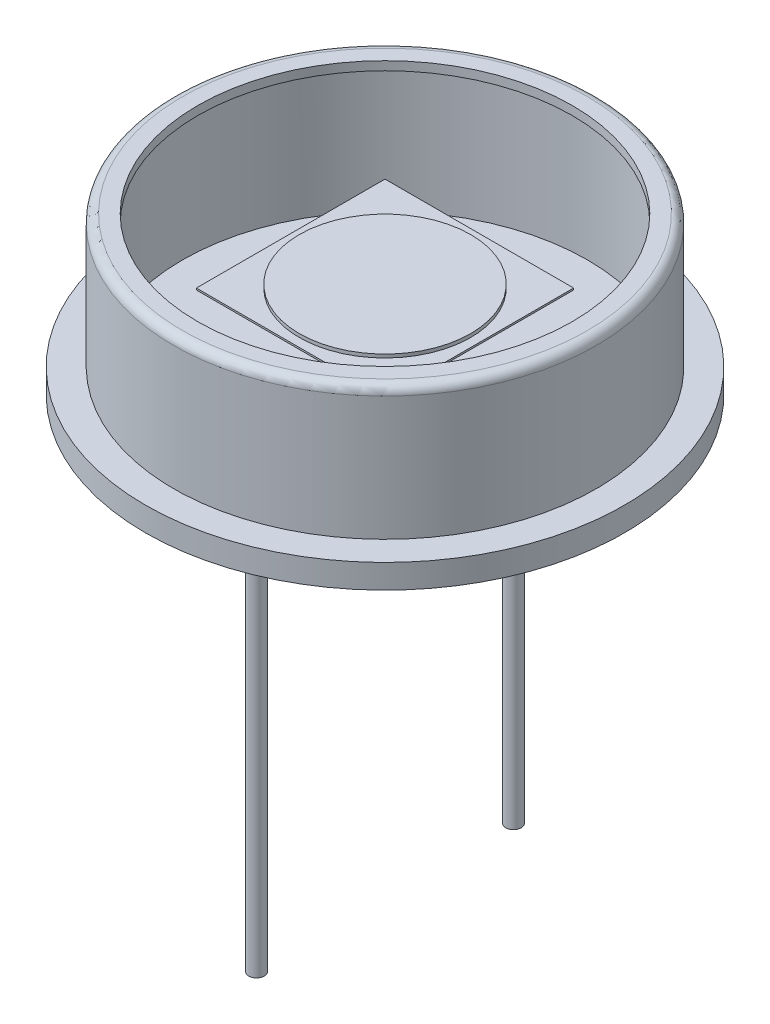
ISO-10303-21;
HEADER;
FILE_DESCRIPTION(('STEP AP214'),'2;1');
FILE_NAME('part.step','',(''),(''),'','','');
FILE_SCHEMA(('AUTOMOTIVE_DESIGN { 1 0 10303 214 1 1 1 1 }'));
ENDSEC;
DATA;
#1=APPLICATION_CONTEXT('core data for automotive mechanical design processes');
#2=APPLICATION_PROTOCOL_DEFINITION('international standard','automotive_design',2000,#1);
#3=PRODUCT_CONTEXT('',#1,'mechanical');
#4=PRODUCT('Part','Part','',(#3));
#5=PRODUCT_RELATED_PRODUCT_CATEGORY('part','',(#4));
#6=PRODUCT_DEFINITION_FORMATION('','',#4);
#7=PRODUCT_DEFINITION_CONTEXT('part definition',#1,'design');
#8=PRODUCT_DEFINITION('design','',#6,#7);
#9=PRODUCT_DEFINITION_SHAPE('','',#8);
#10=(LENGTH_UNIT() NAMED_UNIT(*) SI_UNIT(.MILLI.,.METRE.));
#11=(NAMED_UNIT(*) PLANE_ANGLE_UNIT() SI_UNIT($,.RADIAN.));
#12=(NAMED_UNIT(*) SI_UNIT($,.STERADIAN.) SOLID_ANGLE_UNIT());
#13=UNCERTAINTY_MEASURE_WITH_UNIT(LENGTH_MEASURE(1.E-05),#10,'distance_accuracy_value','');
#14=(GEOMETRIC_REPRESENTATION_CONTEXT(3) GLOBAL_UNCERTAINTY_ASSIGNED_CONTEXT((#13)) GLOBAL_UNIT_ASSIGNED_CONTEXT((#10,
#11,#12)) REPRESENTATION_CONTEXT('',''));
#15=CARTESIAN_POINT('',(0.,0.,0.));
#16=DIRECTION('',(0.,0.,1.));
#17=DIRECTION('',(1.,0.,0.));
#18=AXIS2_PLACEMENT_3D('',#15,#16,#17);
#19=CARTESIAN_POINT('',(-2.75,2.69,-2.75));
#20=DIRECTION('',(0.,-1.,0.));
#21=DIRECTION('',(0.,0.,-1.));
#22=AXIS2_PLACEMENT_3D('',#19,#20,#21);
#23=PLANE('',#22);
#24=DIRECTION('',(0.,0.,-1.));
#25=VECTOR('',#24,1.);
#26=CARTESIAN_POINT('',(-2.75,2.69,2.75));
#27=LINE('',#26,#25);
#28=CARTESIAN_POINT('',(-2.75,2.69,2.75));
#29=VERTEX_POINT('',#28);
#30=CARTESIAN_POINT('',(-2.75,2.69,-2.75));
#31=VERTEX_POINT('',#30);
#32=EDGE_CURVE('E109',#29,#31,#27,.T.);
#33=ORIENTED_EDGE('',*,*,#32,.F.);
#34=DIRECTION('',(-1.,0.,0.));
#35=VECTOR('',#34,1.);
#36=CARTESIAN_POINT('',(-2.75,2.69,2.75));
#37=LINE('',#36,#35);
#38=CARTESIAN_POINT('',(2.75,2.69,2.75));
#39=VERTEX_POINT('',#38);
#40=EDGE_CURVE('E82',#39,#29,#37,.T.);
#41=ORIENTED_EDGE('',*,*,#40,.F.);
#42=DIRECTION('',(0.,0.,1.));
#43=VECTOR('',#42,1.);
#44=CARTESIAN_POINT('',(2.75,2.69,2.75));
#45=LINE('',#44,#43);
#46=CARTESIAN_POINT('',(2.75,2.69,-2.75));
#47=VERTEX_POINT('',#46);
#48=EDGE_CURVE('E76',#47,#39,#45,.T.);
#49=ORIENTED_EDGE('',*,*,#48,.F.);
#50=DIRECTION('',(1.,0.,0.));
#51=VECTOR('',#50,1.);
#52=CARTESIAN_POINT('',(-2.75,2.69,-2.75));
#53=LINE('',#52,#51);
#54=EDGE_CURVE('E100',#31,#47,#53,.T.);
#55=ORIENTED_EDGE('',*,*,#54,.F.);
#56=EDGE_LOOP('',(#33,#41,#49,#55));
#57=FACE_BOUND('',#56,.T.);
#58=CARTESIAN_POINT('',(0.,2.69,0.));
#59=DIRECTION('',(0.,-1.,0.));
#60=DIRECTION('',(0.,0.,-1.));
#61=AXIS2_PLACEMENT_3D('',#58,#59,#60);
#62=CIRCLE('',#61,2.5);
#63=CARTESIAN_POINT('',(0.,2.69,-2.5));
#64=VERTEX_POINT('',#63);
#65=EDGE_CURVE('E12',#64,#64,#62,.F.);
#66=ORIENTED_EDGE('',*,*,#65,.F.);
#67=EDGE_LOOP('',(#66));
#68=FACE_BOUND('',#67,.T.);
#69=ADVANCED_FACE('F42',(#57,#68),#23,.F.);
#70=CARTESIAN_POINT('',(-2.75,2.64,2.75));
#71=DIRECTION('',(1.,0.,0.));
#72=DIRECTION('',(0.,0.,-1.));
#73=AXIS2_PLACEMENT_3D('',#70,#71,#72);
#74=PLANE('',#73);
#75=ORIENTED_EDGE('',*,*,#32,.T.);
#76=DIRECTION('',(0.,1.,0.));
#77=VECTOR('',#76,1.);
#78=CARTESIAN_POINT('',(-2.75,2.64,-2.75));
#79=LINE('',#78,#77);
#80=CARTESIAN_POINT('',(-2.75,2.64,-2.75));
#81=VERTEX_POINT('',#80);
#82=EDGE_CURVE('E51',#81,#31,#79,.T.);
#83=ORIENTED_EDGE('',*,*,#82,.F.);
#84=DIRECTION('',(0.,0.,-1.));
#85=VECTOR('',#84,1.);
#86=CARTESIAN_POINT('',(-2.75,2.64,2.75));
#87=LINE('',#86,#85);
#88=CARTESIAN_POINT('',(-2.75,2.64,2.75));
#89=VERTEX_POINT('',#88);
#90=EDGE_CURVE('E95',#89,#81,#87,.T.);
#91=ORIENTED_EDGE('',*,*,#90,.F.);
#92=DIRECTION('',(0.,1.,0.));
#93=VECTOR('',#92,1.);
#94=CARTESIAN_POINT('',(-2.75,2.64,2.75));
#95=LINE('',#94,#93);
#96=EDGE_CURVE('E105',#89,#29,#95,.T.);
#97=ORIENTED_EDGE('',*,*,#96,.T.);
#98=EDGE_LOOP('',(#75,#83,#91,#97));
#99=FACE_BOUND('',#98,.T.);
#100=ADVANCED_FACE('F44',(#99),#74,.F.);
#101=CARTESIAN_POINT('',(-2.75,2.64,-2.75));
#102=DIRECTION('',(0.,0.,1.));
#103=DIRECTION('',(1.,0.,0.));
#104=AXIS2_PLACEMENT_3D('',#101,#102,#103);
#105=PLANE('',#104);
#106=ORIENTED_EDGE('',*,*,#54,.T.);
#107=DIRECTION('',(0.,1.,0.));
#108=VECTOR('',#107,1.);
#109=CARTESIAN_POINT('',(2.75,2.64,-2.75));
#110=LINE('',#109,#108);
#111=CARTESIAN_POINT('',(2.75,2.64,-2.75));
#112=VERTEX_POINT('',#111);
#113=EDGE_CURVE('E98',#112,#47,#110,.T.);
#114=ORIENTED_EDGE('',*,*,#113,.F.);
#115=DIRECTION('',(1.,0.,0.));
#116=VECTOR('',#115,1.);
#117=CARTESIAN_POINT('',(-2.75,2.64,-2.75));
#118=LINE('',#117,#116);
#119=EDGE_CURVE('E90',#81,#112,#118,.T.);
#120=ORIENTED_EDGE('',*,*,#119,.F.);
#121=ORIENTED_EDGE('',*,*,#82,.T.);
#122=EDGE_LOOP('',(#106,#114,#120,#121));
#123=FACE_BOUND('',#122,.T.);
#124=ADVANCED_FACE('F99',(#123),#105,.F.);
#125=CARTESIAN_POINT('',(2.75,2.64,2.75));
#126=DIRECTION('',(-1.,0.,0.));
#127=DIRECTION('',(0.,0.,1.));
#128=AXIS2_PLACEMENT_3D('',#125,#126,#127);
#129=PLANE('',#128);
#130=ORIENTED_EDGE('',*,*,#48,.T.);
#131=DIRECTION('',(0.,1.,0.));
#132=VECTOR('',#131,1.);
#133=CARTESIAN_POINT('',(2.75,2.64,2.75));
#134=LINE('',#133,#132);
#135=CARTESIAN_POINT('',(2.75,2.64,2.75));
#136=VERTEX_POINT('',#135);
#137=EDGE_CURVE('E101',#136,#39,#134,.T.);
#138=ORIENTED_EDGE('',*,*,#137,.F.);
#139=DIRECTION('',(0.,0.,1.));
#140=VECTOR('',#139,1.);
#141=CARTESIAN_POINT('',(2.75,2.64,2.75));
#142=LINE('',#141,#140);
#143=EDGE_CURVE('E93',#112,#136,#142,.T.);
#144=ORIENTED_EDGE('',*,*,#143,.F.);
#145=ORIENTED_EDGE('',*,*,#113,.T.);
#146=EDGE_LOOP('',(#130,#138,#144,#145));
#147=FACE_BOUND('',#146,.T.);
#148=ADVANCED_FACE('F103',(#147),#129,.F.);
#149=CARTESIAN_POINT('',(-2.75,2.64,2.75));
#150=DIRECTION('',(0.,0.,-1.));
#151=DIRECTION('',(-1.,0.,0.));
#152=AXIS2_PLACEMENT_3D('',#149,#150,#151);
#153=PLANE('',#152);
#154=ORIENTED_EDGE('',*,*,#40,.T.);
#155=ORIENTED_EDGE('',*,*,#96,.F.);
#156=DIRECTION('',(-1.,0.,0.));
#157=VECTOR('',#156,1.);
#158=CARTESIAN_POINT('',(-2.75,2.64,2.75));
#159=LINE('',#158,#157);
#160=EDGE_CURVE('E59',#136,#89,#159,.T.);
#161=ORIENTED_EDGE('',*,*,#160,.F.);
#162=ORIENTED_EDGE('',*,*,#137,.T.);
#163=EDGE_LOOP('',(#154,#155,#161,#162));
#164=FACE_BOUND('',#163,.T.);
#165=ADVANCED_FACE('F136',(#164),#153,.F.);
#166=CARTESIAN_POINT('',(-2.75,2.64,-2.75));
#167=DIRECTION('',(0.,-1.,0.));
#168=DIRECTION('',(0.,0.,-1.));
#169=AXIS2_PLACEMENT_3D('',#166,#167,#168);
#170=PLANE('',#169);
#171=ORIENTED_EDGE('',*,*,#90,.T.);
#172=ORIENTED_EDGE('',*,*,#119,.T.);
#173=ORIENTED_EDGE('',*,*,#143,.T.);
#174=ORIENTED_EDGE('',*,*,#160,.T.);
#175=EDGE_LOOP('',(#171,#172,#173,#174));
#176=FACE_BOUND('',#175,.T.);
#177=ADVANCED_FACE('F91',(#176),#170,.T.);
#178=CARTESIAN_POINT('',(0.,2.79,0.));
#179=DIRECTION('',(0.,-1.,0.));
#180=DIRECTION('',(0.,0.,-1.));
#181=AXIS2_PLACEMENT_3D('',#178,#179,#180);
#182=CYLINDRICAL_SURFACE('',#181,2.5);
#183=CARTESIAN_POINT('',(0.,2.79,0.));
#184=DIRECTION('',(0.,1.,0.));
#185=DIRECTION('',(0.,0.,1.));
#186=AXIS2_PLACEMENT_3D('',#183,#184,#185);
#187=CIRCLE('',#186,2.5);
#188=CARTESIAN_POINT('',(0.,2.79,2.5));
#189=VERTEX_POINT('',#188);
#190=EDGE_CURVE('E112',#189,#189,#187,.T.);
#191=ORIENTED_EDGE('',*,*,#190,.F.);
#192=EDGE_LOOP('',(#191));
#193=FACE_BOUND('',#192,.T.);
#194=ORIENTED_EDGE('',*,*,#65,.T.);
#195=EDGE_LOOP('',(#194));
#196=FACE_BOUND('',#195,.T.);
#197=ADVANCED_FACE('F125',(#193,#196),#182,.T.);
#198=CARTESIAN_POINT('',(0.,2.79,0.));
#199=DIRECTION('',(0.,1.,0.));
#200=DIRECTION('',(0.,0.,1.));
#201=AXIS2_PLACEMENT_3D('',#198,#199,#200);
#202=PLANE('',#201);
#203=ORIENTED_EDGE('',*,*,#190,.T.);
#204=EDGE_LOOP('',(#203));
#205=FACE_BOUND('',#204,.T.);
#206=ADVANCED_FACE('F127',(#205),#202,.T.);
#207=CLOSED_SHELL('',(#69,#100,#124,#148,#165,#177,#197,#206));
#208=MANIFOLD_SOLID_BREP('B2',#207);
#209=CARTESIAN_POINT('',(6.985,0.,0.));
#210=DIRECTION('',(0.,1.,0.));
#211=DIRECTION('',(0.,0.,1.));
#212=AXIS2_PLACEMENT_3D('',#209,#210,#211);
#213=PLANE('',#212);
#214=CARTESIAN_POINT('',(0.,0.,3.745));
#215=DIRECTION('',(0.,1.,0.));
#216=DIRECTION('',(0.,0.,1.));
#217=AXIS2_PLACEMENT_3D('',#214,#215,#216);
#218=CIRCLE('',#217,0.75);
#219=CARTESIAN_POINT('',(0.,0.,4.495));
#220=VERTEX_POINT('',#219);
#221=EDGE_CURVE('E204',#220,#220,#218,.F.);
#222=ORIENTED_EDGE('',*,*,#221,.F.);
#223=EDGE_LOOP('',(#222));
#224=FACE_BOUND('',#223,.T.);
#225=CARTESIAN_POINT('',(0.,0.,-3.745));
#226=DIRECTION('',(0.,1.,0.));
#227=DIRECTION('',(0.,0.,1.));
#228=AXIS2_PLACEMENT_3D('',#225,#226,#227);
#229=CIRCLE('',#228,0.225000000000001);
#230=CARTESIAN_POINT('',(0.,0.,-3.52));
#231=VERTEX_POINT('',#230);
#232=EDGE_CURVE('E208',#231,#231,#229,.F.);
#233=ORIENTED_EDGE('',*,*,#232,.F.);
#234=EDGE_LOOP('',(#233));
#235=FACE_BOUND('',#234,.T.);
#236=CARTESIAN_POINT('',(0.,0.,0.));
#237=DIRECTION('',(0.,-1.,0.));
#238=DIRECTION('',(0.,0.,-1.));
#239=AXIS2_PLACEMENT_3D('',#236,#237,#238);
#240=CIRCLE('',#239,6.985);
#241=CARTESIAN_POINT('',(0.,0.,-6.985));
#242=VERTEX_POINT('',#241);
#243=EDGE_CURVE('E228',#242,#242,#240,.T.);
#244=ORIENTED_EDGE('',*,*,#243,.T.);
#245=EDGE_LOOP('',(#244));
#246=FACE_BOUND('',#245,.T.);
#247=CARTESIAN_POINT('',(-1.97931774602012,0.,-4.71761741307297));
#248=DIRECTION('',(0.,1.,0.));
#249=DIRECTION('',(0.,0.,1.));
#250=AXIS2_PLACEMENT_3D('',#247,#248,#249);
#251=CIRCLE('',#250,0.945778117285004);
#252=CARTESIAN_POINT('',(-1.97931774602012,0.,-3.77183929578797));
#253=VERTEX_POINT('',#252);
#254=EDGE_CURVE('E41',#253,#253,#251,.F.);
#255=ORIENTED_EDGE('',*,*,#254,.F.);
#256=EDGE_LOOP('',(#255));
#257=FACE_BOUND('',#256,.T.);
#258=ADVANCED_FACE('F197',(#224,#235,#246,#257),#213,.F.);
#259=CARTESIAN_POINT('',(5.906,4.57,0.));
#260=DIRECTION('',(0.,1.,0.));
#261=DIRECTION('',(0.,0.,1.));
#262=AXIS2_PLACEMENT_3D('',#259,#260,#261);
#263=PLANE('',#262);
#264=CARTESIAN_POINT('',(0.,4.57,0.));
#265=DIRECTION('',(0.,-1.,0.));
#266=DIRECTION('',(0.,0.,-1.));
#267=AXIS2_PLACEMENT_3D('',#264,#265,#266);
#268=CIRCLE('',#267,5.46);
#269=CARTESIAN_POINT('',(0.,4.57,-5.46));
#270=VERTEX_POINT('',#269);
#271=EDGE_CURVE('E212',#270,#270,#268,.T.);
#272=ORIENTED_EDGE('',*,*,#271,.T.);
#273=EDGE_LOOP('',(#272));
#274=FACE_BOUND('',#273,.T.);
#275=CARTESIAN_POINT('',(0.,4.57,0.));
#276=DIRECTION('',(0.,-1.,0.));
#277=DIRECTION('',(0.,0.,-1.));
#278=AXIS2_PLACEMENT_3D('',#275,#276,#277);
#279=CIRCLE('',#278,5.906);
#280=CARTESIAN_POINT('',(0.,4.57,-5.906));
#281=VERTEX_POINT('',#280);
#282=EDGE_CURVE('E240',#281,#281,#279,.T.);
#283=ORIENTED_EDGE('',*,*,#282,.F.);
#284=EDGE_LOOP('',(#283));
#285=FACE_BOUND('',#284,.T.);
#286=ADVANCED_FACE('F199',(#274,#285),#263,.T.);
#287=CARTESIAN_POINT('',(0.,0.,0.));
#288=DIRECTION('',(0.,-1.,0.));
#289=DIRECTION('',(0.,0.,-1.));
#290=AXIS2_PLACEMENT_3D('',#287,#288,#289);
#291=CYLINDRICAL_SURFACE('',#290,5.46);
#292=ORIENTED_EDGE('',*,*,#271,.F.);
#293=EDGE_LOOP('',(#292));
#294=FACE_BOUND('',#293,.T.);
#295=CARTESIAN_POINT('',(0.,4.316,0.));
#296=DIRECTION('',(0.,-1.,0.));
#297=DIRECTION('',(0.,0.,-1.));
#298=AXIS2_PLACEMENT_3D('',#295,#296,#297);
#299=CIRCLE('',#298,5.46);
#300=CARTESIAN_POINT('',(0.,4.316,-5.46));
#301=VERTEX_POINT('',#300);
#302=EDGE_CURVE('E222',#301,#301,#299,.T.);
#303=ORIENTED_EDGE('',*,*,#302,.T.);
#304=EDGE_LOOP('',(#303));
#305=FACE_BOUND('',#304,.T.);
#306=ADVANCED_FACE('F278',(#294,#305),#291,.F.);
#307=CARTESIAN_POINT('',(5.906,4.316,0.));
#308=DIRECTION('',(0.,1.,0.));
#309=DIRECTION('',(0.,0.,1.));
#310=AXIS2_PLACEMENT_3D('',#307,#308,#309);
#311=PLANE('',#310);
#312=ORIENTED_EDGE('',*,*,#302,.F.);
#313=EDGE_LOOP('',(#312));
#314=FACE_BOUND('',#313,.T.);
#315=CARTESIAN_POINT('',(0.,4.316,0.));
#316=DIRECTION('',(0.,-1.,0.));
#317=DIRECTION('',(0.,0.,-1.));
#318=AXIS2_PLACEMENT_3D('',#315,#316,#317);
#319=CIRCLE('',#318,5.906);
#320=CARTESIAN_POINT('',(0.,4.316,-5.906));
#321=VERTEX_POINT('',#320);
#322=EDGE_CURVE('E225',#321,#321,#319,.T.);
#323=ORIENTED_EDGE('',*,*,#322,.T.);
#324=EDGE_LOOP('',(#323));
#325=FACE_BOUND('',#324,.T.);
#326=ADVANCED_FACE('F288',(#314,#325),#311,.F.);
#327=CARTESIAN_POINT('',(0.,0.,0.));
#328=DIRECTION('',(0.,-1.,0.));
#329=DIRECTION('',(0.,0.,-1.));
#330=AXIS2_PLACEMENT_3D('',#327,#328,#329);
#331=CYLINDRICAL_SURFACE('',#330,5.906);
#332=ORIENTED_EDGE('',*,*,#322,.F.);
#333=EDGE_LOOP('',(#332));
#334=FACE_BOUND('',#333,.T.);
#335=CARTESIAN_POINT('',(0.,0.446,0.));
#336=DIRECTION('',(0.,1.,0.));
#337=DIRECTION('',(0.,0.,1.));
#338=AXIS2_PLACEMENT_3D('',#335,#336,#337);
#339=CIRCLE('',#338,5.906);
#340=CARTESIAN_POINT('',(0.,0.446,5.906));
#341=VERTEX_POINT('',#340);
#342=EDGE_CURVE('E243',#341,#341,#339,.F.);
#343=ORIENTED_EDGE('',*,*,#342,.T.);
#344=EDGE_LOOP('',(#343));
#345=FACE_BOUND('',#344,.T.);
#346=ADVANCED_FACE('F285',(#334,#345),#331,.F.);
#347=CARTESIAN_POINT('',(0.,0.,0.));
#348=DIRECTION('',(0.,-1.,0.));
#349=DIRECTION('',(0.,0.,-1.));
#350=AXIS2_PLACEMENT_3D('',#347,#348,#349);
#351=CYLINDRICAL_SURFACE('',#350,6.985);
#352=CARTESIAN_POINT('',(0.,0.7,0.));
#353=DIRECTION('',(0.,-1.,0.));
#354=DIRECTION('',(0.,0.,-1.));
#355=AXIS2_PLACEMENT_3D('',#352,#353,#354);
#356=CIRCLE('',#355,6.985);
#357=CARTESIAN_POINT('',(0.,0.7,-6.985));
#358=VERTEX_POINT('',#357);
#359=EDGE_CURVE('E231',#358,#358,#356,.T.);
#360=ORIENTED_EDGE('',*,*,#359,.T.);
#361=EDGE_LOOP('',(#360));
#362=FACE_BOUND('',#361,.T.);
#363=ORIENTED_EDGE('',*,*,#243,.F.);
#364=EDGE_LOOP('',(#363));
#365=FACE_BOUND('',#364,.T.);
#366=ADVANCED_FACE('F283',(#362,#365),#351,.T.);
#367=CARTESIAN_POINT('',(6.985,0.7,0.));
#368=DIRECTION('',(0.,1.,0.));
#369=DIRECTION('',(0.,0.,1.));
#370=AXIS2_PLACEMENT_3D('',#367,#368,#369);
#371=PLANE('',#370);
#372=CARTESIAN_POINT('',(0.,0.7,0.));
#373=DIRECTION('',(0.,-1.,0.));
#374=DIRECTION('',(0.,0.,-1.));
#375=AXIS2_PLACEMENT_3D('',#372,#373,#374);
#376=CIRCLE('',#375,6.16);
#377=CARTESIAN_POINT('',(0.,0.7,-6.16));
#378=VERTEX_POINT('',#377);
#379=EDGE_CURVE('E234',#378,#378,#376,.T.);
#380=ORIENTED_EDGE('',*,*,#379,.T.);
#381=EDGE_LOOP('',(#380));
#382=FACE_BOUND('',#381,.T.);
#383=ORIENTED_EDGE('',*,*,#359,.F.);
#384=EDGE_LOOP('',(#383));
#385=FACE_BOUND('',#384,.T.);
#386=ADVANCED_FACE('F322',(#382,#385),#371,.T.);
#387=CARTESIAN_POINT('',(0.,0.,0.));
#388=DIRECTION('',(0.,-1.,0.));
#389=DIRECTION('',(0.,0.,-1.));
#390=AXIS2_PLACEMENT_3D('',#387,#388,#389);
#391=CYLINDRICAL_SURFACE('',#390,6.16);
#392=CARTESIAN_POINT('',(0.,4.316,0.));
#393=DIRECTION('',(0.,-1.,0.));
#394=DIRECTION('',(0.,0.,-1.));
#395=AXIS2_PLACEMENT_3D('',#392,#393,#394);
#396=CIRCLE('',#395,6.16);
#397=CARTESIAN_POINT('',(0.,4.316,-6.16));
#398=VERTEX_POINT('',#397);
#399=EDGE_CURVE('E237',#398,#398,#396,.T.);
#400=ORIENTED_EDGE('',*,*,#399,.T.);
#401=EDGE_LOOP('',(#400));
#402=FACE_BOUND('',#401,.T.);
#403=ORIENTED_EDGE('',*,*,#379,.F.);
#404=EDGE_LOOP('',(#403));
#405=FACE_BOUND('',#404,.T.);
#406=ADVANCED_FACE('F316',(#402,#405),#391,.T.);
#407=CARTESIAN_POINT('',(0.,4.316,0.));
#408=DIRECTION('',(0.,-1.,0.));
#409=DIRECTION('',(0.,0.,-1.));
#410=AXIS2_PLACEMENT_3D('',#407,#408,#409);
#411=TOROIDAL_SURFACE('',#410,5.906,0.254);
#412=ORIENTED_EDGE('',*,*,#282,.T.);
#413=EDGE_LOOP('',(#412));
#414=FACE_BOUND('',#413,.T.);
#415=ORIENTED_EDGE('',*,*,#399,.F.);
#416=EDGE_LOOP('',(#415));
#417=FACE_BOUND('',#416,.T.);
#418=ADVANCED_FACE('F307',(#414,#417),#411,.T.);
#419=CARTESIAN_POINT('',(6.985,0.446,0.));
#420=DIRECTION('',(0.,1.,0.));
#421=DIRECTION('',(0.,0.,1.));
#422=AXIS2_PLACEMENT_3D('',#419,#420,#421);
#423=PLANE('',#422);
#424=ORIENTED_EDGE('',*,*,#342,.F.);
#425=EDGE_LOOP('',(#424));
#426=FACE_BOUND('',#425,.T.);
#427=ADVANCED_FACE('F304',(#426),#423,.T.);
#428=CARTESIAN_POINT('',(0.,-12.7,-3.745));
#429=DIRECTION('',(0.,1.,0.));
#430=DIRECTION('',(0.,0.,1.));
#431=AXIS2_PLACEMENT_3D('',#428,#429,#430);
#432=CYLINDRICAL_SURFACE('',#431,0.225000000000001);
#433=CARTESIAN_POINT('',(0.,-12.7,-3.745));
#434=DIRECTION('',(0.,-1.,0.));
#435=DIRECTION('',(0.,0.,1.));
#436=AXIS2_PLACEMENT_3D('',#433,#434,#435);
#437=CIRCLE('',#436,0.225000000000001);
#438=CARTESIAN_POINT('',(0.,-12.7,-3.52));
#439=VERTEX_POINT('',#438);
#440=EDGE_CURVE('E246',#439,#439,#437,.T.);
#441=ORIENTED_EDGE('',*,*,#440,.F.);
#442=EDGE_LOOP('',(#441));
#443=FACE_BOUND('',#442,.T.);
#444=ORIENTED_EDGE('',*,*,#232,.T.);
#445=EDGE_LOOP('',(#444));
#446=FACE_BOUND('',#445,.T.);
#447=ADVANCED_FACE('F306',(#443,#446),#432,.T.);
#448=CARTESIAN_POINT('',(0.,-12.7,-3.745));
#449=DIRECTION('',(0.,1.,0.));
#450=DIRECTION('',(0.,0.,1.));
#451=AXIS2_PLACEMENT_3D('',#448,#449,#450);
#452=PLANE('',#451);
#453=ORIENTED_EDGE('',*,*,#440,.T.);
#454=EDGE_LOOP('',(#453));
#455=FACE_BOUND('',#454,.T.);
#456=ADVANCED_FACE('F313',(#455),#452,.F.);
#457=CARTESIAN_POINT('',(0.,-0.4,3.745));
#458=DIRECTION('',(0.,-1.,0.));
#459=DIRECTION('',(0.,0.,-1.));
#460=AXIS2_PLACEMENT_3D('',#457,#458,#459);
#461=PLANE('',#460);
#462=CARTESIAN_POINT('',(0.,-0.4,3.745));
#463=DIRECTION('',(0.,-1.,0.));
#464=DIRECTION('',(0.,0.,-1.));
#465=AXIS2_PLACEMENT_3D('',#462,#463,#464);
#466=CIRCLE('',#465,0.75);
#467=CARTESIAN_POINT('',(0.,-0.4,2.995));
#468=VERTEX_POINT('',#467);
#469=EDGE_CURVE('E218',#468,#468,#466,.T.);
#470=ORIENTED_EDGE('',*,*,#469,.T.);
#471=EDGE_LOOP('',(#470));
#472=FACE_BOUND('',#471,.T.);
#473=CARTESIAN_POINT('',(0.,-0.399999999999999,3.745));
#474=DIRECTION('',(0.,-1.,0.));
#475=DIRECTION('',(0.,0.,-1.));
#476=AXIS2_PLACEMENT_3D('',#473,#474,#475);
#477=CIRCLE('',#476,0.225000000000001);
#478=CARTESIAN_POINT('',(0.,-0.399999999999999,3.52));
#479=VERTEX_POINT('',#478);
#480=EDGE_CURVE('E215',#479,#479,#477,.T.);
#481=ORIENTED_EDGE('',*,*,#480,.F.);
#482=EDGE_LOOP('',(#481));
#483=FACE_BOUND('',#482,.T.);
#484=ADVANCED_FACE('F396',(#472,#483),#461,.T.);
#485=CARTESIAN_POINT('',(0.,-0.4,3.745));
#486=DIRECTION('',(0.,1.,0.));
#487=DIRECTION('',(0.,0.,1.));
#488=AXIS2_PLACEMENT_3D('',#485,#486,#487);
#489=CYLINDRICAL_SURFACE('',#488,0.75);
#490=ORIENTED_EDGE('',*,*,#469,.F.);
#491=EDGE_LOOP('',(#490));
#492=FACE_BOUND('',#491,.T.);
#493=ORIENTED_EDGE('',*,*,#221,.T.);
#494=EDGE_LOOP('',(#493));
#495=FACE_BOUND('',#494,.T.);
#496=ADVANCED_FACE('F410',(#492,#495),#489,.T.);
#497=CARTESIAN_POINT('',(0.,-12.7,3.745));
#498=DIRECTION('',(0.,-1.,0.));
#499=DIRECTION('',(0.,0.,-1.));
#500=AXIS2_PLACEMENT_3D('',#497,#498,#499);
#501=PLANE('',#500);
#502=CARTESIAN_POINT('',(0.,-12.7,3.745));
#503=DIRECTION('',(0.,-1.,0.));
#504=DIRECTION('',(0.,0.,-1.));
#505=AXIS2_PLACEMENT_3D('',#502,#503,#504);
#506=CIRCLE('',#505,0.225000000000001);
#507=CARTESIAN_POINT('',(0.,-12.7,3.52));
#508=VERTEX_POINT('',#507);
#509=EDGE_CURVE('E217',#508,#508,#506,.T.);
#510=ORIENTED_EDGE('',*,*,#509,.T.);
#511=EDGE_LOOP('',(#510));
#512=FACE_BOUND('',#511,.T.);
#513=ADVANCED_FACE('F268',(#512),#501,.T.);
#514=CARTESIAN_POINT('',(0.,-12.7,3.745));
#515=DIRECTION('',(0.,1.,0.));
#516=DIRECTION('',(0.,0.,1.));
#517=AXIS2_PLACEMENT_3D('',#514,#515,#516);
#518=CYLINDRICAL_SURFACE('',#517,0.225000000000001);
#519=ORIENTED_EDGE('',*,*,#480,.T.);
#520=EDGE_LOOP('',(#519));
#521=FACE_BOUND('',#520,.T.);
#522=ORIENTED_EDGE('',*,*,#509,.F.);
#523=EDGE_LOOP('',(#522));
#524=FACE_BOUND('',#523,.T.);
#525=ADVANCED_FACE('F261',(#521,#524),#518,.T.);
#526=CARTESIAN_POINT('',(-1.97931774602012,-0.01,-4.71761741307297));
#527=DIRECTION('',(0.,1.,0.));
#528=DIRECTION('',(0.,0.,1.));
#529=AXIS2_PLACEMENT_3D('',#526,#527,#528);
#530=CYLINDRICAL_SURFACE('',#529,0.945778117285004);
#531=CARTESIAN_POINT('',(-1.97931774602012,-0.01,-4.71761741307297));
#532=DIRECTION('',(0.,-1.,0.));
#533=DIRECTION('',(0.,0.,-1.));
#534=AXIS2_PLACEMENT_3D('',#531,#532,#533);
#535=CIRCLE('',#534,0.945778117285004);
#536=CARTESIAN_POINT('',(-1.97931774602012,-0.01,-5.66339553035798));
#537=VERTEX_POINT('',#536);
#538=EDGE_CURVE('E253',#537,#537,#535,.T.);
#539=ORIENTED_EDGE('',*,*,#538,.F.);
#540=EDGE_LOOP('',(#539));
#541=FACE_BOUND('',#540,.T.);
#542=ORIENTED_EDGE('',*,*,#254,.T.);
#543=EDGE_LOOP('',(#542));
#544=FACE_BOUND('',#543,.T.);
#545=ADVANCED_FACE('F259',(#541,#544),#530,.T.);
#546=CARTESIAN_POINT('',(-1.97931774602012,-0.01,-4.71761741307297));
#547=DIRECTION('',(0.,-1.,0.));
#548=DIRECTION('',(0.,0.,-1.));
#549=AXIS2_PLACEMENT_3D('',#546,#547,#548);
#550=PLANE('',#549);
#551=ORIENTED_EDGE('',*,*,#538,.T.);
#552=EDGE_LOOP('',(#551));
#553=FACE_BOUND('',#552,.T.);
#554=ADVANCED_FACE('F257',(#553),#550,.T.);
#555=CLOSED_SHELL('',(#258,#286,#306,#326,#346,#366,#386,#406,#418,#427,#447,#456,#484,#496,
#513,#525,#545,#554));
#556=MANIFOLD_SOLID_BREP('B6',#555);
#557=ADVANCED_BREP_SHAPE_REPRESENTATION('',(#18,#208,#556),#14);
#558=SHAPE_DEFINITION_REPRESENTATION(#9,#557);
ENDSEC;
END-ISO-10303-21;
